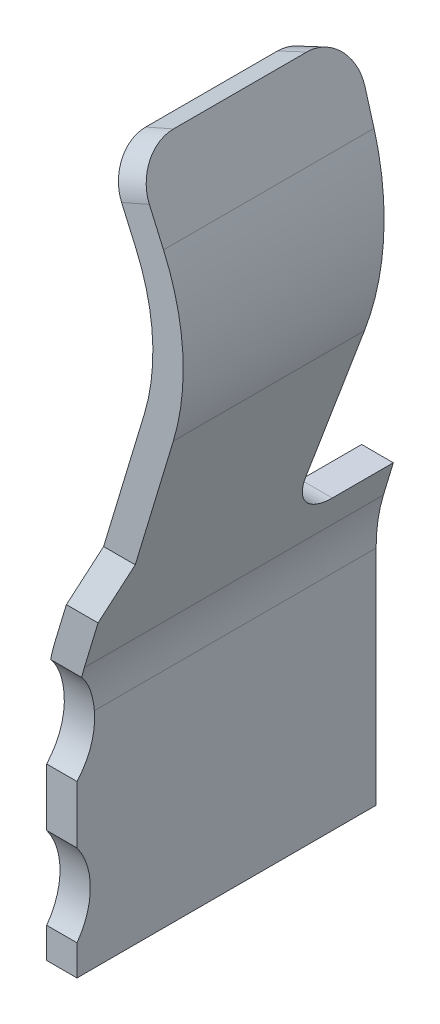
ISO-10303-21;
HEADER;
FILE_DESCRIPTION(('STEP AP214'),'2;1');
FILE_NAME('part.step','',(''),(''),'','','');
FILE_SCHEMA(('AUTOMOTIVE_DESIGN { 1 0 10303 214 1 1 1 1 }'));
ENDSEC;
DATA;
#1=APPLICATION_CONTEXT('core data for automotive mechanical design processes');
#2=APPLICATION_PROTOCOL_DEFINITION('international standard','automotive_design',2000,#1);
#3=PRODUCT_CONTEXT('',#1,'mechanical');
#4=PRODUCT('Part','Part','',(#3));
#5=PRODUCT_RELATED_PRODUCT_CATEGORY('part','',(#4));
#6=PRODUCT_DEFINITION_FORMATION('','',#4);
#7=PRODUCT_DEFINITION_CONTEXT('part definition',#1,'design');
#8=PRODUCT_DEFINITION('design','',#6,#7);
#9=PRODUCT_DEFINITION_SHAPE('','',#8);
#10=(LENGTH_UNIT() NAMED_UNIT(*) SI_UNIT(.MILLI.,.METRE.));
#11=(NAMED_UNIT(*) PLANE_ANGLE_UNIT() SI_UNIT($,.RADIAN.));
#12=(NAMED_UNIT(*) SI_UNIT($,.STERADIAN.) SOLID_ANGLE_UNIT());
#13=UNCERTAINTY_MEASURE_WITH_UNIT(LENGTH_MEASURE(1.E-05),#10,'distance_accuracy_value','');
#14=(GEOMETRIC_REPRESENTATION_CONTEXT(3) GLOBAL_UNCERTAINTY_ASSIGNED_CONTEXT((#13)) GLOBAL_UNIT_ASSIGNED_CONTEXT((#10,
#11,#12)) REPRESENTATION_CONTEXT('',''));
#15=CARTESIAN_POINT('',(0.,0.,0.));
#16=DIRECTION('',(0.,0.,1.));
#17=DIRECTION('',(1.,0.,0.));
#18=AXIS2_PLACEMENT_3D('',#15,#16,#17);
#19=CARTESIAN_POINT('',(-9.47613725867002,3.53312166947706,-0.236832722369338));
#20=DIRECTION('',(-0.914255270392897,-0.402239697454475,0.0483789866630426));
#21=DIRECTION('',(0.402711251685505,-0.915327071470026,0.));
#22=AXIS2_PLACEMENT_3D('',#19,#20,#21);
#23=CYLINDRICAL_SURFACE('',#22,0.2);
#24=CARTESIAN_POINT('',(-9.48964147732528,3.50329761180303,-0.434687053017797));
#25=CARTESIAN_POINT('',(-9.54071840447186,3.6193909515076,-0.448650066039084));
#26=CARTESIAN_POINT('',(-9.57898718351819,3.70637250294574,-0.363398989614743));
#27=CARTESIAN_POINT('',(-9.57898718351818,3.70637250294574,-0.235652283248446));
#28=(BOUNDED_CURVE() B_SPLINE_CURVE(3,(#24,#25,#26,#27),.UNSPECIFIED.,.F.,
.F.) B_SPLINE_CURVE_WITH_KNOTS((4,4),(3.0320715031167,4.71238898038462),
.UNSPECIFIED.) CURVE() GEOMETRIC_REPRESENTATION_ITEM() RATIONAL_B_SPLINE_CURVE((1.,
0.778229742533871,0.778229742533871,1.)) REPRESENTATION_ITEM(''));
#29=CARTESIAN_POINT('',(-9.48964147732528,3.50329761180303,-0.434687053017797));
#30=VERTEX_POINT('',#29);
#31=CARTESIAN_POINT('',(-9.57898718351818,3.70637250294574,-0.235652283248446));
#32=VERTEX_POINT('',#31);
#33=EDGE_CURVE('E289',#30,#32,#28,.T.);
#34=ORIENTED_EDGE('',*,*,#33,.F.);
#35=DIRECTION('',(0.914255270392898,0.402239697454473,-0.0483789866630426));
#36=VECTOR('',#35,1.);
#37=CARTESIAN_POINT('',(-33.537177596038,-7.07676024092296,0.837819069551529));
#38=LINE('',#37,#36);
#39=CARTESIAN_POINT('',(-9.62694053804578,3.44289092405021,-0.427421697659669));
#40=VERTEX_POINT('',#39);
#41=EDGE_CURVE('E11',#40,#30,#38,.T.);
#42=ORIENTED_EDGE('',*,*,#41,.F.);
#43=CARTESIAN_POINT('',(-9.71628624423869,3.64596581519291,-0.228386927890318));
#44=CARTESIAN_POINT('',(-9.71628624423869,3.64596581519291,-0.356133634256616));
#45=CARTESIAN_POINT('',(-9.67801746519238,3.55898426375477,-0.441384710680957));
#46=CARTESIAN_POINT('',(-9.62694053804578,3.44289092405021,-0.427421697659669));
#47=(BOUNDED_CURVE() B_SPLINE_CURVE(3,(#43,#44,#45,#46),.UNSPECIFIED.,.F.,
.F.) B_SPLINE_CURVE_WITH_KNOTS((4,4),(1.57079632679495,3.25111380406287),
.UNSPECIFIED.) CURVE() GEOMETRIC_REPRESENTATION_ITEM() RATIONAL_B_SPLINE_CURVE((1.,
0.778229742533869,0.778229742533869,1.)) REPRESENTATION_ITEM(''));
#48=CARTESIAN_POINT('',(-9.71628624423869,3.64596581519291,-0.228386927890318));
#49=VERTEX_POINT('',#48);
#50=EDGE_CURVE('E315',#49,#40,#47,.T.);
#51=ORIENTED_EDGE('',*,*,#50,.F.);
#52=DIRECTION('',(-0.914255270392898,-0.402239697454473,0.0483789866630426));
#53=VECTOR('',#52,1.);
#54=CARTESIAN_POINT('',(-9.55667950900712,3.71618708377106,-0.236832722369339));
#55=LINE('',#54,#53);
#56=EDGE_CURVE('E417',#32,#49,#55,.T.);
#57=ORIENTED_EDGE('',*,*,#56,.F.);
#58=EDGE_LOOP('',(#34,#42,#51,#57));
#59=FACE_BOUND('',#58,.T.);
#60=ADVANCED_FACE('F16',(#59),#23,.T.);
#61=CARTESIAN_POINT('',(-9.49844493318108,3.52330708865174,0.423604352914838));
#62=DIRECTION('',(0.915327071470026,0.402711251685505,0.));
#63=DIRECTION('',(-0.402711251685505,0.915327071470026,0.));
#64=AXIS2_PLACEMENT_3D('',#61,#62,#63);
#65=CYLINDRICAL_SURFACE('',#64,0.2);
#66=CARTESIAN_POINT('',(-9.63574399390159,3.46290040089891,0.423604352914837));
#67=DIRECTION('',(-0.915327071470029,-0.402711251685498,0.));
#68=DIRECTION('',(-0.402711251685498,0.915327071470029,0.));
#69=AXIS2_PLACEMENT_3D('',#66,#67,#68);
#70=CIRCLE('',#69,0.2);
#71=CARTESIAN_POINT('',(-9.63574399390159,3.46290040089891,0.623604352914837));
#72=VERTEX_POINT('',#71);
#73=CARTESIAN_POINT('',(-9.71628624423869,3.64596581519291,0.423604352914837));
#74=VERTEX_POINT('',#73);
#75=EDGE_CURVE('E416',#72,#74,#70,.T.);
#76=ORIENTED_EDGE('',*,*,#75,.F.);
#77=DIRECTION('',(-0.915327071470027,-0.402711251685503,0.));
#78=VECTOR('',#77,1.);
#79=CARTESIAN_POINT('',(-34.2530633966531,-7.36784176638169,0.623604352914803));
#80=LINE('',#79,#78);
#81=CARTESIAN_POINT('',(-9.49844493318109,3.52330708865174,0.623604352914837));
#82=VERTEX_POINT('',#81);
#83=EDGE_CURVE('E27',#82,#72,#80,.T.);
#84=ORIENTED_EDGE('',*,*,#83,.F.);
#85=CARTESIAN_POINT('',(-9.49844493318109,3.52330708865174,0.423604352914838));
#86=DIRECTION('',(0.915327071470029,0.402711251685498,0.));
#87=DIRECTION('',(0.402711251685498,-0.915327071470029,0.));
#88=AXIS2_PLACEMENT_3D('',#85,#86,#87);
#89=CIRCLE('',#88,0.2);
#90=CARTESIAN_POINT('',(-9.57898718351819,3.70637250294574,0.423604352914837));
#91=VERTEX_POINT('',#90);
#92=EDGE_CURVE('E283',#91,#82,#89,.T.);
#93=ORIENTED_EDGE('',*,*,#92,.F.);
#94=DIRECTION('',(0.915327071470027,0.402711251685503,0.));
#95=VECTOR('',#94,1.);
#96=CARTESIAN_POINT('',(-9.57898718351819,3.70637250294574,0.423604352914837));
#97=LINE('',#96,#95);
#98=EDGE_CURVE('E288',#74,#91,#97,.T.);
#99=ORIENTED_EDGE('',*,*,#98,.F.);
#100=EDGE_LOOP('',(#76,#84,#93,#99));
#101=FACE_BOUND('',#100,.T.);
#102=ADVANCED_FACE('F501',(#101),#65,.T.);
#103=CARTESIAN_POINT('',(-38.35,1.65634067151207,-0.212546111318104));
#104=DIRECTION('',(0.,-1.,0.));
#105=DIRECTION('',(0.,0.,-1.));
#106=AXIS2_PLACEMENT_3D('',#103,#104,#105);
#107=PLANE('',#106);
#108=DIRECTION('',(0.,0.,-1.));
#109=VECTOR('',#108,1.);
#110=CARTESIAN_POINT('',(-9.81150340910558,1.65634067151207,-0.740000000000021));
#111=LINE('',#110,#109);
#112=CARTESIAN_POINT('',(-9.81150340910558,1.65634067151207,-0.438042305987955));
#113=VERTEX_POINT('',#112);
#114=CARTESIAN_POINT('',(-9.81150340910558,1.65634067151207,-0.740000000000021));
#115=VERTEX_POINT('',#114);
#116=EDGE_CURVE('E311',#113,#115,#111,.T.);
#117=ORIENTED_EDGE('',*,*,#116,.F.);
#118=DIRECTION('',(1.,0.,0.));
#119=VECTOR('',#118,1.);
#120=CARTESIAN_POINT('',(-9.65483507894155,1.65634067151207,-0.438042305987954));
#121=LINE('',#120,#119);
#122=CARTESIAN_POINT('',(-9.65483507894154,1.65634067151207,-0.438042305987954));
#123=VERTEX_POINT('',#122);
#124=EDGE_CURVE('E232',#113,#123,#121,.T.);
#125=ORIENTED_EDGE('',*,*,#124,.T.);
#126=DIRECTION('',(0.,0.,1.));
#127=VECTOR('',#126,1.);
#128=CARTESIAN_POINT('',(-9.65483507894154,1.65634067151207,-0.74000000000002));
#129=LINE('',#128,#127);
#130=CARTESIAN_POINT('',(-9.65483507894154,1.65634067151207,-0.74000000000002));
#131=VERTEX_POINT('',#130);
#132=EDGE_CURVE('E227',#131,#123,#129,.T.);
#133=ORIENTED_EDGE('',*,*,#132,.F.);
#134=DIRECTION('',(-1.,0.,0.));
#135=VECTOR('',#134,1.);
#136=CARTESIAN_POINT('',(-8.89,1.65634067151207,-0.740000000000019));
#137=LINE('',#136,#135);
#138=EDGE_CURVE('E296',#131,#115,#137,.T.);
#139=ORIENTED_EDGE('',*,*,#138,.T.);
#140=EDGE_LOOP('',(#117,#125,#133,#139));
#141=FACE_BOUND('',#140,.T.);
#142=ADVANCED_FACE('F507',(#141),#107,.F.);
#143=CARTESIAN_POINT('',(-38.35,3.70637250294571,-0.459111687165995));
#144=DIRECTION('',(0.,0.119413416546905,0.992844618230162));
#145=DIRECTION('',(1.,0.,0.));
#146=AXIS2_PLACEMENT_3D('',#143,#144,#145);
#147=PLANE('',#146);
#148=DIRECTION('',(0.286748539926818,0.951150986717315,-0.11439875574724));
#149=VECTOR('',#148,1.);
#150=CARTESIAN_POINT('',(-9.68587763511194,1.55337185451571,-0.200161637444148));
#151=LINE('',#150,#149);
#152=CARTESIAN_POINT('',(-9.58733997726959,1.88022335482146,-0.239473382341922));
#153=VERTEX_POINT('',#152);
#154=CARTESIAN_POINT('',(-9.37979823954622,2.56864369924933,-0.322272466749581));
#155=VERTEX_POINT('',#154);
#156=EDGE_CURVE('E408',#153,#155,#151,.T.);
#157=ORIENTED_EDGE('',*,*,#156,.F.);
#158=DIRECTION('',(-1.,0.,0.));
#159=VECTOR('',#158,1.);
#160=CARTESIAN_POINT('',(-9.81150340910559,1.88022335482146,-0.239473382341922));
#161=LINE('',#160,#159);
#162=CARTESIAN_POINT('',(-9.74400830743363,1.88022335482146,-0.239473382341922));
#163=VERTEX_POINT('',#162);
#164=EDGE_CURVE('E238',#153,#163,#161,.T.);
#165=ORIENTED_EDGE('',*,*,#164,.T.);
#166=DIRECTION('',(-0.28674853992682,-0.951150986717314,0.11439875574724));
#167=VECTOR('',#166,1.);
#168=CARTESIAN_POINT('',(-9.82966395488851,1.59610175610151,-0.205300934614505));
#169=LINE('',#168,#167);
#170=CARTESIAN_POINT('',(-9.52341373590366,2.61194022573825,-0.327479914176623));
#171=VERTEX_POINT('',#170);
#172=EDGE_CURVE('E330',#171,#163,#169,.T.);
#173=ORIENTED_EDGE('',*,*,#172,.F.);
#174=CARTESIAN_POINT('',(-9.56552330681659,3.30329498734983,-0.410631932744419));
#175=CARTESIAN_POINT('',(-9.46854501029241,3.08287189317973,-0.384120760424612));
#176=CARTESIAN_POINT('',(-9.45390448882343,2.84250387207174,-0.355210731501567));
#177=CARTESIAN_POINT('',(-9.52341373590366,2.61194022573825,-0.327479914176623));
#178=(BOUNDED_CURVE() B_SPLINE_CURVE(3,(#174,#175,#176,#177),.UNSPECIFIED.,.F.,
.F.) B_SPLINE_CURVE_WITH_KNOTS((4,4),(4.29791199977039,5.00519872138853),
.UNSPECIFIED.) CURVE() GEOMETRIC_REPRESENTATION_ITEM() RATIONAL_B_SPLINE_CURVE((1.,
0.958744787021091,0.958744787021091,1.)) REPRESENTATION_ITEM(''));
#179=CARTESIAN_POINT('',(-9.56552330681659,3.30329498734983,-0.410631932744419));
#180=VERTEX_POINT('',#179);
#181=EDGE_CURVE('E294',#180,#171,#178,.T.);
#182=ORIENTED_EDGE('',*,*,#181,.F.);
#183=DIRECTION('',(0.400292818236851,-0.909830186054405,0.109428936813833));
#184=VECTOR('',#183,1.);
#185=CARTESIAN_POINT('',(-9.57995081965594,3.33608744850051,-0.414576013974334));
#186=LINE('',#185,#184);
#187=EDGE_CURVE('E295',#40,#180,#186,.T.);
#188=ORIENTED_EDGE('',*,*,#187,.F.);
#189=ORIENTED_EDGE('',*,*,#41,.T.);
#190=DIRECTION('',(-0.40029281823685,0.909830186054405,-0.109428936813833));
#191=VECTOR('',#190,1.);
#192=CARTESIAN_POINT('',(-9.44233351008822,3.39577078475993,-0.421754368938235));
#193=LINE('',#192,#191);
#194=CARTESIAN_POINT('',(-9.42822424609609,3.36370167510267,-0.417897288102547));
#195=VERTEX_POINT('',#194);
#196=EDGE_CURVE('E282',#195,#30,#193,.T.);
#197=ORIENTED_EDGE('',*,*,#196,.F.);
#198=CARTESIAN_POINT('',(-9.37979823954622,2.56864369924933,-0.322272466749581));
#199=CARTESIAN_POINT('',(-9.29986260540396,2.83379189253285,-0.354162906673267));
#200=CARTESIAN_POINT('',(-9.31669920509328,3.11021511680704,-0.387409439934769));
#201=CARTESIAN_POINT('',(-9.42822424609609,3.36370167510267,-0.417897288102547));
#202=(BOUNDED_CURVE() B_SPLINE_CURVE(3,(#198,#199,#200,#201),.UNSPECIFIED.,.F.,
.F.) B_SPLINE_CURVE_WITH_KNOTS((4,4),(1.27798658579106,1.98527330740919),
.UNSPECIFIED.) CURVE() GEOMETRIC_REPRESENTATION_ITEM() RATIONAL_B_SPLINE_CURVE((1.,
0.958744787021091,0.958744787021091,1.)) REPRESENTATION_ITEM(''));
#203=EDGE_CURVE('E388',#155,#195,#202,.T.);
#204=ORIENTED_EDGE('',*,*,#203,.F.);
#205=EDGE_LOOP('',(#157,#165,#173,#182,#188,#189,#197,#204));
#206=FACE_BOUND('',#205,.T.);
#207=ADVANCED_FACE('F18',(#206),#147,.F.);
#208=CARTESIAN_POINT('',(-38.35,1.94413292378283,0.623604352914797));
#209=DIRECTION('',(0.,0.,-1.));
#210=DIRECTION('',(0.,-1.,0.));
#211=AXIS2_PLACEMENT_3D('',#208,#209,#210);
#212=PLANE('',#211);
#213=DIRECTION('',(0.4027112516855,-0.915327071470028,0.));
#214=VECTOR('',#213,1.);
#215=CARTESIAN_POINT('',(-9.42822424609609,3.36370167510267,0.623604352914838));
#216=LINE('',#215,#214);
#217=CARTESIAN_POINT('',(-9.42822424609609,3.36370167510267,0.623604352914838));
#218=VERTEX_POINT('',#217);
#219=EDGE_CURVE('E279',#82,#218,#216,.T.);
#220=ORIENTED_EDGE('',*,*,#219,.F.);
#221=ORIENTED_EDGE('',*,*,#83,.T.);
#222=DIRECTION('',(-0.402711251685501,0.915327071470028,0.));
#223=VECTOR('',#222,1.);
#224=CARTESIAN_POINT('',(-9.56552330681659,3.30329498734984,0.623604352914837));
#225=LINE('',#224,#223);
#226=CARTESIAN_POINT('',(-9.56552330681659,3.30329498734983,0.623604352914837));
#227=VERTEX_POINT('',#226);
#228=EDGE_CURVE('E413',#227,#72,#225,.T.);
#229=ORIENTED_EDGE('',*,*,#228,.F.);
#230=CARTESIAN_POINT('',(-10.4808503782866,2.90058373566433,0.623604352914836));
#231=DIRECTION('',(0.,0.,1.));
#232=DIRECTION('',(-1.,0.,0.));
#233=AXIS2_PLACEMENT_3D('',#230,#231,#232);
#234=CIRCLE('',#233,1.);
#235=CARTESIAN_POINT('',(-9.52341373590367,2.61194022573825,0.623604352914837));
#236=VERTEX_POINT('',#235);
#237=EDGE_CURVE('E304',#236,#227,#234,.T.);
#238=ORIENTED_EDGE('',*,*,#237,.F.);
#239=DIRECTION('',(0.28864350992609,0.957436642382956,0.));
#240=VECTOR('',#239,1.);
#241=CARTESIAN_POINT('',(-9.84743664238296,1.53714937485737,0.623604352914836));
#242=LINE('',#241,#240);
#243=CARTESIAN_POINT('',(-9.72474115022836,1.94413292378283,0.623604352914837));
#244=VERTEX_POINT('',#243);
#245=EDGE_CURVE('E274',#244,#236,#242,.T.);
#246=ORIENTED_EDGE('',*,*,#245,.F.);
#247=DIRECTION('',(1.,0.,0.));
#248=VECTOR('',#247,1.);
#249=CARTESIAN_POINT('',(-38.35,1.94413292378283,0.623604352914797));
#250=LINE('',#249,#248);
#251=CARTESIAN_POINT('',(-9.56807282006433,1.94413292378283,0.623604352914837));
#252=VERTEX_POINT('',#251);
#253=EDGE_CURVE('E299',#244,#252,#250,.T.);
#254=ORIENTED_EDGE('',*,*,#253,.T.);
#255=DIRECTION('',(-0.288643509926088,-0.957436642382956,0.));
#256=VECTOR('',#255,1.);
#257=CARTESIAN_POINT('',(-9.70382114602552,1.49385284836845,0.623604352914837));
#258=LINE('',#257,#256);
#259=CARTESIAN_POINT('',(-9.37979823954622,2.56864369924933,0.623604352914837));
#260=VERTEX_POINT('',#259);
#261=EDGE_CURVE('E316',#260,#252,#258,.T.);
#262=ORIENTED_EDGE('',*,*,#261,.F.);
#263=CARTESIAN_POINT('',(-10.4808503782866,2.90058373566433,0.623604352914836));
#264=DIRECTION('',(0.,0.,-1.));
#265=DIRECTION('',(-1.,0.,0.));
#266=AXIS2_PLACEMENT_3D('',#263,#264,#265);
#267=CIRCLE('',#266,1.15);
#268=EDGE_CURVE('E260',#218,#260,#267,.T.);
#269=ORIENTED_EDGE('',*,*,#268,.F.);
#270=EDGE_LOOP('',(#220,#221,#229,#238,#246,#254,#262,#269));
#271=FACE_BOUND('',#270,.T.);
#272=ADVANCED_FACE('F522',(#271),#212,.F.);
#273=CARTESIAN_POINT('',(-38.35,1.7003498353216,0.749999999999972));
#274=DIRECTION('',(0.,-0.460287319631494,-0.887770005906065));
#275=DIRECTION('',(0.,-0.887770005906065,0.460287319631494));
#276=AXIS2_PLACEMENT_3D('',#273,#274,#275);
#277=PLANE('',#276);
#278=ORIENTED_EDGE('',*,*,#253,.F.);
#279=DIRECTION('',(0.258541028225373,0.857586072334425,-0.444637678635293));
#280=VECTOR('',#279,1.);
#281=CARTESIAN_POINT('',(-9.66642343830644,2.13757401070795,0.523309818502746));
#282=LINE('',#281,#280);
#283=CARTESIAN_POINT('',(-9.79242108767926,1.7196371362757,0.73999999999998));
#284=VERTEX_POINT('',#283);
#285=EDGE_CURVE('E268',#284,#244,#282,.T.);
#286=ORIENTED_EDGE('',*,*,#285,.F.);
#287=DIRECTION('',(-1.,0.,0.));
#288=VECTOR('',#287,1.);
#289=CARTESIAN_POINT('',(-8.89,1.7196371362757,0.739999999999981));
#290=LINE('',#289,#288);
#291=CARTESIAN_POINT('',(-9.63575275751523,1.7196371362757,0.73999999999998));
#292=VERTEX_POINT('',#291);
#293=EDGE_CURVE('E392',#292,#284,#290,.T.);
#294=ORIENTED_EDGE('',*,*,#293,.F.);
#295=DIRECTION('',(-0.258541028225372,-0.857586072334425,0.444637678635293));
#296=VECTOR('',#295,1.);
#297=CARTESIAN_POINT('',(-9.5202273619162,2.10283732290249,0.541319952677682));
#298=LINE('',#297,#296);
#299=EDGE_CURVE('E320',#252,#292,#298,.T.);
#300=ORIENTED_EDGE('',*,*,#299,.F.);
#301=EDGE_LOOP('',(#278,#286,#294,#300));
#302=FACE_BOUND('',#301,.T.);
#303=ADVANCED_FACE('F497',(#302),#277,.F.);
#304=CARTESIAN_POINT('',(-8.89,1.24850586493128,0.739999999999981));
#305=DIRECTION('',(0.,0.,-1.));
#306=DIRECTION('',(0.,-1.,0.));
#307=AXIS2_PLACEMENT_3D('',#304,#305,#306);
#308=PLANE('',#307);
#309=DIRECTION('',(0.,1.,0.));
#310=VECTOR('',#309,1.);
#311=CARTESIAN_POINT('',(-9.74,0.145965815192914,0.73999999999998));
#312=LINE('',#311,#310);
#313=CARTESIAN_POINT('',(-9.74,0.145965815192914,0.73999999999998));
#314=VERTEX_POINT('',#313);
#315=CARTESIAN_POINT('',(-9.74,0.296740599868486,0.73999999999998));
#316=VERTEX_POINT('',#315);
#317=EDGE_CURVE('E259',#314,#316,#312,.T.);
#318=ORIENTED_EDGE('',*,*,#317,.T.);
#319=DIRECTION('',(-1.,0.,0.));
#320=VECTOR('',#319,1.);
#321=CARTESIAN_POINT('',(-38.35,0.296740599868486,0.73999999999994));
#322=LINE('',#321,#320);
#323=CARTESIAN_POINT('',(-9.89,0.296740599868486,0.739999999999979));
#324=VERTEX_POINT('',#323);
#325=EDGE_CURVE('E327',#316,#324,#322,.T.);
#326=ORIENTED_EDGE('',*,*,#325,.T.);
#327=DIRECTION('',(0.,-1.,0.));
#328=VECTOR('',#327,1.);
#329=CARTESIAN_POINT('',(-9.89,0.145965815192914,0.739999999999979));
#330=LINE('',#329,#328);
#331=CARTESIAN_POINT('',(-9.89,0.145965815192914,0.739999999999979));
#332=VERTEX_POINT('',#331);
#333=EDGE_CURVE('E249',#324,#332,#330,.T.);
#334=ORIENTED_EDGE('',*,*,#333,.T.);
#335=DIRECTION('',(1.,0.,0.));
#336=VECTOR('',#335,1.);
#337=CARTESIAN_POINT('',(-9.74,0.145965815192914,0.73999999999998));
#338=LINE('',#337,#336);
#339=EDGE_CURVE('E421',#332,#314,#338,.T.);
#340=ORIENTED_EDGE('',*,*,#339,.T.);
#341=EDGE_LOOP('',(#318,#326,#334,#340));
#342=FACE_BOUND('',#341,.T.);
#343=ADVANCED_FACE('F492',(#342),#308,.F.);
#344=CARTESIAN_POINT('',(-8.89,1.24850586493128,-0.740000000000019));
#345=DIRECTION('',(0.,0.,-1.));
#346=DIRECTION('',(0.,-1.,0.));
#347=AXIS2_PLACEMENT_3D('',#344,#345,#346);
#348=PLANE('',#347);
#349=ORIENTED_EDGE('',*,*,#138,.F.);
#350=DIRECTION('',(0.288643509926088,0.957436642382956,0.));
#351=VECTOR('',#350,1.);
#352=CARTESIAN_POINT('',(-9.70382114602551,1.49385284836845,-0.74000000000002));
#353=LINE('',#352,#351);
#354=CARTESIAN_POINT('',(-9.70382114602551,1.49385284836845,-0.74000000000002));
#355=VERTEX_POINT('',#354);
#356=EDGE_CURVE('E307',#355,#131,#353,.T.);
#357=ORIENTED_EDGE('',*,*,#356,.F.);
#358=CARTESIAN_POINT('',(-8.89,1.24850586493128,-0.740000000000019));
#359=DIRECTION('',(0.,0.,-1.));
#360=DIRECTION('',(1.,0.,0.));
#361=AXIS2_PLACEMENT_3D('',#358,#359,#360);
#362=CIRCLE('',#361,0.85);
#363=CARTESIAN_POINT('',(-9.74,1.24850586493128,-0.74000000000002));
#364=VERTEX_POINT('',#363);
#365=EDGE_CURVE('E258',#364,#355,#362,.T.);
#366=ORIENTED_EDGE('',*,*,#365,.F.);
#367=DIRECTION('',(0.,1.,0.));
#368=VECTOR('',#367,1.);
#369=CARTESIAN_POINT('',(-9.74,0.145965815192914,-0.74000000000002));
#370=LINE('',#369,#368);
#371=CARTESIAN_POINT('',(-9.74,0.145965815192914,-0.74000000000002));
#372=VERTEX_POINT('',#371);
#373=EDGE_CURVE('E251',#372,#364,#370,.T.);
#374=ORIENTED_EDGE('',*,*,#373,.F.);
#375=DIRECTION('',(1.,0.,0.));
#376=VECTOR('',#375,1.);
#377=CARTESIAN_POINT('',(-9.74,0.145965815192914,-0.74000000000002));
#378=LINE('',#377,#376);
#379=CARTESIAN_POINT('',(-9.89,0.145965815192914,-0.740000000000021));
#380=VERTEX_POINT('',#379);
#381=EDGE_CURVE('E368',#380,#372,#378,.T.);
#382=ORIENTED_EDGE('',*,*,#381,.F.);
#383=DIRECTION('',(0.,-1.,0.));
#384=VECTOR('',#383,1.);
#385=CARTESIAN_POINT('',(-9.89,0.145965815192914,-0.740000000000021));
#386=LINE('',#385,#384);
#387=CARTESIAN_POINT('',(-9.89,1.24850586493128,-0.740000000000021));
#388=VERTEX_POINT('',#387);
#389=EDGE_CURVE('E41',#388,#380,#386,.T.);
#390=ORIENTED_EDGE('',*,*,#389,.F.);
#391=CARTESIAN_POINT('',(-8.89,1.24850586493128,-0.740000000000019));
#392=DIRECTION('',(0.,0.,1.));
#393=DIRECTION('',(1.,0.,0.));
#394=AXIS2_PLACEMENT_3D('',#391,#392,#393);
#395=CIRCLE('',#394,1.);
#396=CARTESIAN_POINT('',(-9.84743664238296,1.53714937485737,-0.740000000000021));
#397=VERTEX_POINT('',#396);
#398=EDGE_CURVE('E391',#397,#388,#395,.T.);
#399=ORIENTED_EDGE('',*,*,#398,.F.);
#400=DIRECTION('',(-0.28864350992609,-0.957436642382956,0.));
#401=VECTOR('',#400,1.);
#402=CARTESIAN_POINT('',(-9.84743664238296,1.53714937485737,-0.740000000000021));
#403=LINE('',#402,#401);
#404=EDGE_CURVE('E269',#115,#397,#403,.T.);
#405=ORIENTED_EDGE('',*,*,#404,.F.);
#406=EDGE_LOOP('',(#349,#357,#366,#374,#382,#390,#399,#405));
#407=FACE_BOUND('',#406,.T.);
#408=ADVANCED_FACE('F482',(#407),#348,.T.);
#409=CARTESIAN_POINT('',(-9.89,0.145965815192914,-0.740000000000021));
#410=DIRECTION('',(1.,0.,0.));
#411=DIRECTION('',(0.,1.,0.));
#412=AXIS2_PLACEMENT_3D('',#409,#410,#411);
#413=PLANE('',#412);
#414=DIRECTION('',(0.,-1.,0.));
#415=VECTOR('',#414,1.);
#416=CARTESIAN_POINT('',(-9.89,0.145965815192914,0.739999999999979));
#417=LINE('',#416,#415);
#418=CARTESIAN_POINT('',(-9.89,0.988055123608201,0.739999999999979));
#419=VERTEX_POINT('',#418);
#420=CARTESIAN_POINT('',(-9.89,0.703259400131467,0.739999999999979));
#421=VERTEX_POINT('',#420);
#422=EDGE_CURVE('E428',#419,#421,#417,.T.);
#423=ORIENTED_EDGE('',*,*,#422,.F.);
#424=CARTESIAN_POINT('',(-9.89,1.21669179396546,0.995153761033096));
#425=DIRECTION('',(1.,0.,0.));
#426=DIRECTION('',(0.,1.,0.));
#427=AXIS2_PLACEMENT_3D('',#424,#425,#426);
#428=CIRCLE('',#427,0.342604974863759);
#429=CARTESIAN_POINT('',(-9.89,1.24850586493128,0.654029100989324));
#430=VERTEX_POINT('',#429);
#431=EDGE_CURVE('E340',#419,#430,#428,.T.);
#432=ORIENTED_EDGE('',*,*,#431,.T.);
#433=DIRECTION('',(0.,0.,1.));
#434=VECTOR('',#433,1.);
#435=CARTESIAN_POINT('',(-9.89,1.24850586493128,-0.740000000000021));
#436=LINE('',#435,#434);
#437=EDGE_CURVE('E278',#388,#430,#436,.T.);
#438=ORIENTED_EDGE('',*,*,#437,.F.);
#439=ORIENTED_EDGE('',*,*,#389,.T.);
#440=DIRECTION('',(0.,0.,1.));
#441=VECTOR('',#440,1.);
#442=CARTESIAN_POINT('',(-9.89,0.145965815192914,-0.740000000000021));
#443=LINE('',#442,#441);
#444=EDGE_CURVE('E373',#380,#332,#443,.T.);
#445=ORIENTED_EDGE('',*,*,#444,.T.);
#446=ORIENTED_EDGE('',*,*,#333,.F.);
#447=CARTESIAN_POINT('',(-9.89,0.499999999999977,1.0194268345702));
#448=DIRECTION('',(1.,0.,0.));
#449=DIRECTION('',(0.,1.,0.));
#450=AXIS2_PLACEMENT_3D('',#447,#448,#449);
#451=CIRCLE('',#450,0.345533991988848);
#452=EDGE_CURVE('E334',#324,#421,#451,.T.);
#453=ORIENTED_EDGE('',*,*,#452,.T.);
#454=EDGE_LOOP('',(#423,#432,#438,#439,#445,#446,#453));
#455=FACE_BOUND('',#454,.T.);
#456=ADVANCED_FACE('F471',(#455),#413,.F.);
#457=CARTESIAN_POINT('',(-8.89,1.24850586493128,-0.740000000000019));
#458=DIRECTION('',(0.,0.,1.));
#459=DIRECTION('',(-1.,0.,0.));
#460=AXIS2_PLACEMENT_3D('',#457,#458,#459);
#461=CYLINDRICAL_SURFACE('',#460,1.);
#462=ORIENTED_EDGE('',*,*,#437,.T.);
#463=CARTESIAN_POINT('',(-9.89,1.24850586493127,0.654029100989324));
#464=CARTESIAN_POINT('',(-9.89000007407363,1.25306932177748,0.654454497923835));
#465=CARTESIAN_POINT('',(-9.88996876472137,1.25762446546712,0.654969794425774));
#466=CARTESIAN_POINT('',(-9.88984483490432,1.26669234380872,0.656178662703507));
#467=CARTESIAN_POINT('',(-9.88975245079703,1.27120517419842,0.656871540938563));
#468=CARTESIAN_POINT('',(-9.88950808670678,1.28018764830056,0.658435530000101));
#469=CARTESIAN_POINT('',(-9.88935624289613,1.28465736694881,0.659306231418194));
#470=CARTESIAN_POINT('',(-9.88899477703105,1.29355289226453,0.661225514697385));
#471=CARTESIAN_POINT('',(-9.8887851944591,1.29797872680563,0.66227397481712));
#472=CARTESIAN_POINT('',(-9.88831002792707,1.30678583476397,0.664548502475786));
#473=CARTESIAN_POINT('',(-9.88804439252603,1.31116706334694,0.665774732832754));
#474=CARTESIAN_POINT('',(-9.88745889152881,1.31988437499395,0.668404514864849));
#475=CARTESIAN_POINT('',(-9.88713889099457,1.32422031651338,0.669808505488944));
#476=CARTESIAN_POINT('',(-9.88644641069623,1.33284654509273,0.672793524574298));
#477=CARTESIAN_POINT('',(-9.88607372137307,1.33713657245114,0.67437525453736));
#478=CARTESIAN_POINT('',(-9.88527760241854,1.34567049059148,0.677715533217567));
#479=CARTESIAN_POINT('',(-9.88485389867301,1.34991398511754,0.679475028174295));
#480=CARTESIAN_POINT('',(-9.88396321849389,1.35830019523904,0.683146652073494));
#481=CARTESIAN_POINT('',(-9.88349650719558,1.36244335249443,0.6850578369075));
#482=CARTESIAN_POINT('',(-9.88252312860201,1.37063194178074,0.689033531510101));
#483=CARTESIAN_POINT('',(-9.88201661211662,1.3746776733665,0.691097460992356));
#484=CARTESIAN_POINT('',(-9.88096713168236,1.38267128376232,0.695378434355306));
#485=CARTESIAN_POINT('',(-9.88042424735263,1.3866193519919,0.697595144046891));
#486=CARTESIAN_POINT('',(-9.87930544298223,1.39441764648526,0.702181418874192));
#487=CARTESIAN_POINT('',(-9.87872954299439,1.39826793013232,0.704550891332612));
#488=CARTESIAN_POINT('',(-9.87754802962805,1.40587073759695,0.709442454924468));
#489=CARTESIAN_POINT('',(-9.87694238918284,1.40962316741917,0.71196468558873));
#490=CARTESIAN_POINT('',(-9.87570462073635,1.4170304504751,0.717161525963166));
#491=CARTESIAN_POINT('',(-9.87507243147301,1.42068504210779,0.719836493879692));
#492=CARTESIAN_POINT('',(-9.87378470654221,1.42789683764576,0.725338623347789));
#493=CARTESIAN_POINT('',(-9.87312908847075,1.43145359950846,0.728166344681211));
#494=CARTESIAN_POINT('',(-9.87179751594577,1.43847023752972,0.733973670299353));
#495=CARTESIAN_POINT('',(-9.87112147050096,1.44192948379825,0.736954014976151));
#496=CARTESIAN_POINT('',(-9.87043911813473,1.44532846432271,0.73999999999998));
#497=B_SPLINE_CURVE_WITH_KNOTS('',3,(#463,#464,#465,#466,#467,#468,#469,#470,#471,#472,#473,
#474,#475,#476,#477,#478,#479,#480,#481,#482,#483,#484,#485,#486,#487,#488,#489,#490,#491,#492,
#493,#494,#495,#496),.UNSPECIFIED.,.F.,.F.,(4,2,2,2,2,2,2,2,2,2,2,2,2,2,2,2,4),(0.,
0.013748827736232,0.0274447569667543,0.0411095020469267,0.0547649260984996,0.0684329369744623,
0.0821353821572885,0.0958939450956066,0.109730045405059,0.123485924962942,0.137191991355335,
0.150868974599206,0.164537737053089,0.17821917870054,0.191934141578146,0.205703315519925,
0.219547147320743),.UNSPECIFIED.);
#498=CARTESIAN_POINT('',(-9.87043911813473,1.44532846432271,0.739999999999979));
#499=VERTEX_POINT('',#498);
#500=EDGE_CURVE('E453',#430,#499,#497,.T.);
#501=ORIENTED_EDGE('',*,*,#500,.T.);
#502=CARTESIAN_POINT('',(-8.89,1.24850586493128,0.739999999999981));
#503=DIRECTION('',(0.,0.,1.));
#504=DIRECTION('',(1.,0.,0.));
#505=AXIS2_PLACEMENT_3D('',#502,#503,#504);
#506=CIRCLE('',#505,1.);
#507=CARTESIAN_POINT('',(-9.84743664238296,1.53714937485737,0.739999999999979));
#508=VERTEX_POINT('',#507);
#509=EDGE_CURVE('E551',#508,#499,#506,.T.);
#510=ORIENTED_EDGE('',*,*,#509,.F.);
#511=DIRECTION('',(0.,0.,1.));
#512=VECTOR('',#511,1.);
#513=CARTESIAN_POINT('',(-9.84743664238296,1.53714937485737,-0.740000000000021));
#514=LINE('',#513,#512);
#515=EDGE_CURVE('E265',#397,#508,#514,.T.);
#516=ORIENTED_EDGE('',*,*,#515,.F.);
#517=ORIENTED_EDGE('',*,*,#398,.T.);
#518=EDGE_LOOP('',(#462,#501,#510,#516,#517));
#519=FACE_BOUND('',#518,.T.);
#520=ADVANCED_FACE('F460',(#519),#461,.T.);
#521=CARTESIAN_POINT('',(-9.84743664238296,1.53714937485737,-0.740000000000021));
#522=DIRECTION('',(0.957436642382956,-0.28864350992609,0.));
#523=DIRECTION('',(0.,0.,-1.));
#524=AXIS2_PLACEMENT_3D('',#521,#522,#523);
#525=PLANE('',#524);
#526=ORIENTED_EDGE('',*,*,#172,.T.);
#527=CARTESIAN_POINT('',(-9.74400830743363,1.88022335482146,-0.239473382341922));
#528=CARTESIAN_POINT('',(-9.74639827429865,1.87229578405696,-0.238519901512672));
#529=CARTESIAN_POINT('',(-9.74880115558452,1.86432537588468,-0.238042305987954));
#530=CARTESIAN_POINT('',(-9.75120834682184,1.85634067151208,-0.238042305987954));
#531=(BOUNDED_CURVE() B_SPLINE_CURVE(3,(#527,#528,#529,#530),.UNSPECIFIED.,.F.,
.F.) B_SPLINE_CURVE_WITH_KNOTS((4,4),(4.59268992994791,4.71238898038469),
.UNSPECIFIED.) CURVE() GEOMETRIC_REPRESENTATION_ITEM() RATIONAL_B_SPLINE_CURVE((1.,
0.998806367803328,0.998806367803328,1.)) REPRESENTATION_ITEM(''));
#532=CARTESIAN_POINT('',(-9.75120834682184,1.85634067151208,-0.238042305987954));
#533=VERTEX_POINT('',#532);
#534=EDGE_CURVE('E346',#163,#533,#531,.T.);
#535=ORIENTED_EDGE('',*,*,#534,.T.);
#536=CARTESIAN_POINT('',(-9.75120834682184,1.85634067151208,-0.238042305987954));
#537=CARTESIAN_POINT('',(-9.78652837656353,1.73918338398669,-0.238042305987954));
#538=CARTESIAN_POINT('',(-9.81150340910557,1.65634067151208,-0.320885018462573));
#539=CARTESIAN_POINT('',(-9.81150340910558,1.65634067151207,-0.438042305987955));
#540=(BOUNDED_CURVE() B_SPLINE_CURVE(3,(#536,#537,#538,#539),.UNSPECIFIED.,.F.,
.F.) B_SPLINE_CURVE_WITH_KNOTS((4,4),(4.71238898038469,6.28318530717959),
.UNSPECIFIED.) CURVE() GEOMETRIC_REPRESENTATION_ITEM() RATIONAL_B_SPLINE_CURVE((1.,
0.804737854124365,0.804737854124365,1.)) REPRESENTATION_ITEM(''));
#541=EDGE_CURVE('E355',#533,#113,#540,.T.);
#542=ORIENTED_EDGE('',*,*,#541,.T.);
#543=ORIENTED_EDGE('',*,*,#116,.T.);
#544=ORIENTED_EDGE('',*,*,#404,.T.);
#545=ORIENTED_EDGE('',*,*,#515,.T.);
#546=DIRECTION('',(-0.28864350992609,-0.957436642382956,0.));
#547=VECTOR('',#546,1.);
#548=CARTESIAN_POINT('',(-9.84743664238296,1.53714937485737,0.739999999999979));
#549=LINE('',#548,#547);
#550=EDGE_CURVE('E396',#284,#508,#549,.T.);
#551=ORIENTED_EDGE('',*,*,#550,.F.);
#552=ORIENTED_EDGE('',*,*,#285,.T.);
#553=ORIENTED_EDGE('',*,*,#245,.T.);
#554=DIRECTION('',(0.,0.,1.));
#555=VECTOR('',#554,1.);
#556=CARTESIAN_POINT('',(-9.52341373590366,2.61194022573825,-0.74000000000002));
#557=LINE('',#556,#555);
#558=EDGE_CURVE('E300',#171,#236,#557,.T.);
#559=ORIENTED_EDGE('',*,*,#558,.F.);
#560=EDGE_LOOP('',(#526,#535,#542,#543,#544,#545,#551,#552,#553,#559));
#561=FACE_BOUND('',#560,.T.);
#562=ADVANCED_FACE('F470',(#561),#525,.F.);
#563=CARTESIAN_POINT('',(-10.4808503782866,2.90058373566433,-0.740000000000021));
#564=DIRECTION('',(0.,0.,1.));
#565=DIRECTION('',(-1.,0.,0.));
#566=AXIS2_PLACEMENT_3D('',#563,#564,#565);
#567=CYLINDRICAL_SURFACE('',#566,1.);
#568=DIRECTION('',(0.,0.,1.));
#569=VECTOR('',#568,1.);
#570=CARTESIAN_POINT('',(-9.56552330681659,3.30329498734983,-0.74000000000002));
#571=LINE('',#570,#569);
#572=EDGE_CURVE('E290',#180,#227,#571,.T.);
#573=ORIENTED_EDGE('',*,*,#572,.F.);
#574=ORIENTED_EDGE('',*,*,#181,.T.);
#575=ORIENTED_EDGE('',*,*,#558,.T.);
#576=ORIENTED_EDGE('',*,*,#237,.T.);
#577=EDGE_LOOP('',(#573,#574,#575,#576));
#578=FACE_BOUND('',#577,.T.);
#579=ADVANCED_FACE('F478',(#578),#567,.F.);
#580=CARTESIAN_POINT('',(-9.56552330681658,3.30329498734984,-0.74000000000002));
#581=DIRECTION('',(0.915327071470028,0.402711251685501,0.));
#582=DIRECTION('',(0.,0.,-1.));
#583=AXIS2_PLACEMENT_3D('',#580,#581,#582);
#584=PLANE('',#583);
#585=ORIENTED_EDGE('',*,*,#228,.T.);
#586=ORIENTED_EDGE('',*,*,#75,.T.);
#587=DIRECTION('',(0.,0.,1.));
#588=VECTOR('',#587,1.);
#589=CARTESIAN_POINT('',(-9.71628624423869,3.64596581519291,-0.740000000000021));
#590=LINE('',#589,#588);
#591=EDGE_CURVE('E284',#49,#74,#590,.T.);
#592=ORIENTED_EDGE('',*,*,#591,.F.);
#593=ORIENTED_EDGE('',*,*,#50,.T.);
#594=ORIENTED_EDGE('',*,*,#187,.T.);
#595=ORIENTED_EDGE('',*,*,#572,.T.);
#596=EDGE_LOOP('',(#585,#586,#592,#593,#594,#595));
#597=FACE_BOUND('',#596,.T.);
#598=ADVANCED_FACE('F474',(#597),#584,.F.);
#599=CARTESIAN_POINT('',(-9.57898718351818,3.70637250294574,-0.74000000000002));
#600=DIRECTION('',(0.402711251685503,-0.915327071470027,0.));
#601=DIRECTION('',(0.,0.,-1.));
#602=AXIS2_PLACEMENT_3D('',#599,#600,#601);
#603=PLANE('',#602);
#604=ORIENTED_EDGE('',*,*,#591,.T.);
#605=ORIENTED_EDGE('',*,*,#98,.T.);
#606=DIRECTION('',(0.,0.,1.));
#607=VECTOR('',#606,1.);
#608=CARTESIAN_POINT('',(-9.57898718351818,3.70637250294574,-0.74000000000002));
#609=LINE('',#608,#607);
#610=EDGE_CURVE('E263',#32,#91,#609,.T.);
#611=ORIENTED_EDGE('',*,*,#610,.F.);
#612=ORIENTED_EDGE('',*,*,#56,.T.);
#613=EDGE_LOOP('',(#604,#605,#611,#612));
#614=FACE_BOUND('',#613,.T.);
#615=ADVANCED_FACE('F477',(#614),#603,.F.);
#616=CARTESIAN_POINT('',(-9.42822424609609,3.36370167510267,-0.74000000000002));
#617=DIRECTION('',(-0.915327071470028,-0.4027112516855,0.));
#618=DIRECTION('',(-0.4027112516855,0.915327071470028,0.));
#619=AXIS2_PLACEMENT_3D('',#616,#617,#618);
#620=PLANE('',#619);
#621=ORIENTED_EDGE('',*,*,#610,.T.);
#622=ORIENTED_EDGE('',*,*,#92,.T.);
#623=ORIENTED_EDGE('',*,*,#219,.T.);
#624=DIRECTION('',(0.,0.,1.));
#625=VECTOR('',#624,1.);
#626=CARTESIAN_POINT('',(-9.42822424609609,3.36370167510267,-0.74000000000002));
#627=LINE('',#626,#625);
#628=EDGE_CURVE('E264',#195,#218,#627,.T.);
#629=ORIENTED_EDGE('',*,*,#628,.F.);
#630=ORIENTED_EDGE('',*,*,#196,.T.);
#631=ORIENTED_EDGE('',*,*,#33,.T.);
#632=EDGE_LOOP('',(#621,#622,#623,#629,#630,#631));
#633=FACE_BOUND('',#632,.T.);
#634=ADVANCED_FACE('F489',(#633),#620,.F.);
#635=CARTESIAN_POINT('',(-10.4808503782866,2.90058373566433,-0.740000000000021));
#636=DIRECTION('',(0.,0.,1.));
#637=DIRECTION('',(-1.,0.,0.));
#638=AXIS2_PLACEMENT_3D('',#635,#636,#637);
#639=CYLINDRICAL_SURFACE('',#638,1.15);
#640=DIRECTION('',(0.,0.,1.));
#641=VECTOR('',#640,1.);
#642=CARTESIAN_POINT('',(-9.37979823954622,2.56864369924933,-0.74000000000002));
#643=LINE('',#642,#641);
#644=EDGE_CURVE('E321',#155,#260,#643,.T.);
#645=ORIENTED_EDGE('',*,*,#644,.F.);
#646=ORIENTED_EDGE('',*,*,#203,.T.);
#647=ORIENTED_EDGE('',*,*,#628,.T.);
#648=ORIENTED_EDGE('',*,*,#268,.T.);
#649=EDGE_LOOP('',(#645,#646,#647,#648));
#650=FACE_BOUND('',#649,.T.);
#651=ADVANCED_FACE('F487',(#650),#639,.T.);
#652=CARTESIAN_POINT('',(-9.70382114602551,1.49385284836845,-0.74000000000002));
#653=DIRECTION('',(-0.957436642382956,0.288643509926088,0.));
#654=DIRECTION('',(0.,0.,1.));
#655=AXIS2_PLACEMENT_3D('',#652,#653,#654);
#656=PLANE('',#655);
#657=ORIENTED_EDGE('',*,*,#356,.T.);
#658=ORIENTED_EDGE('',*,*,#132,.T.);
#659=CARTESIAN_POINT('',(-9.65483507894154,1.65634067151207,-0.438042305987954));
#660=CARTESIAN_POINT('',(-9.65483507894154,1.65634067151208,-0.320885018462573));
#661=CARTESIAN_POINT('',(-9.62986004639949,1.73918338398669,-0.238042305987954));
#662=CARTESIAN_POINT('',(-9.5945400166578,1.85634067151208,-0.238042305987954));
#663=(BOUNDED_CURVE() B_SPLINE_CURVE(3,(#659,#660,#661,#662),.UNSPECIFIED.,.F.,
.F.) B_SPLINE_CURVE_WITH_KNOTS((4,4),(0.,1.5707963267949),
.UNSPECIFIED.) CURVE() GEOMETRIC_REPRESENTATION_ITEM() RATIONAL_B_SPLINE_CURVE((1.,
0.804737854124365,0.804737854124365,1.)) REPRESENTATION_ITEM(''));
#664=CARTESIAN_POINT('',(-9.5945400166578,1.85634067151208,-0.238042305987954));
#665=VERTEX_POINT('',#664);
#666=EDGE_CURVE('E220',#123,#665,#663,.T.);
#667=ORIENTED_EDGE('',*,*,#666,.T.);
#668=CARTESIAN_POINT('',(-9.5945400166578,1.85634067151208,-0.238042305987954));
#669=CARTESIAN_POINT('',(-9.59213282542048,1.86432537588468,-0.238042305987954));
#670=CARTESIAN_POINT('',(-9.58972994413461,1.87229578405696,-0.238519901512672));
#671=CARTESIAN_POINT('',(-9.58733997726959,1.88022335482146,-0.239473382341922));
#672=(BOUNDED_CURVE() B_SPLINE_CURVE(3,(#668,#669,#670,#671),.UNSPECIFIED.,.F.,
.F.) B_SPLINE_CURVE_WITH_KNOTS((4,4),(1.5707963267949,1.69049537723168),
.UNSPECIFIED.) CURVE() GEOMETRIC_REPRESENTATION_ITEM() RATIONAL_B_SPLINE_CURVE((1.,
0.998806367803328,0.998806367803328,1.)) REPRESENTATION_ITEM(''));
#673=EDGE_CURVE('E225',#665,#153,#672,.T.);
#674=ORIENTED_EDGE('',*,*,#673,.T.);
#675=ORIENTED_EDGE('',*,*,#156,.T.);
#676=ORIENTED_EDGE('',*,*,#644,.T.);
#677=ORIENTED_EDGE('',*,*,#261,.T.);
#678=ORIENTED_EDGE('',*,*,#299,.T.);
#679=DIRECTION('',(0.288643509926088,0.957436642382956,0.));
#680=VECTOR('',#679,1.);
#681=CARTESIAN_POINT('',(-9.70382114602552,1.49385284836845,0.73999999999998));
#682=LINE('',#681,#680);
#683=CARTESIAN_POINT('',(-9.70382114602552,1.49385284836845,0.73999999999998));
#684=VERTEX_POINT('',#683);
#685=EDGE_CURVE('E397',#684,#292,#682,.T.);
#686=ORIENTED_EDGE('',*,*,#685,.F.);
#687=DIRECTION('',(0.,0.,1.));
#688=VECTOR('',#687,1.);
#689=CARTESIAN_POINT('',(-9.70382114602551,1.49385284836845,-0.74000000000002));
#690=LINE('',#689,#688);
#691=EDGE_CURVE('E273',#355,#684,#690,.T.);
#692=ORIENTED_EDGE('',*,*,#691,.F.);
#693=EDGE_LOOP('',(#657,#658,#667,#674,#675,#676,#677,#678,#686,#692));
#694=FACE_BOUND('',#693,.T.);
#695=ADVANCED_FACE('F223',(#694),#656,.F.);
#696=CARTESIAN_POINT('',(-8.89,1.24850586493128,-0.740000000000019));
#697=DIRECTION('',(0.,0.,1.));
#698=DIRECTION('',(-1.,0.,0.));
#699=AXIS2_PLACEMENT_3D('',#696,#697,#698);
#700=CYLINDRICAL_SURFACE('',#699,0.85);
#701=CARTESIAN_POINT('',(-8.89,1.24850586493128,0.739999999999981));
#702=DIRECTION('',(0.,0.,-1.));
#703=DIRECTION('',(1.,0.,0.));
#704=AXIS2_PLACEMENT_3D('',#701,#702,#703);
#705=CIRCLE('',#704,0.85);
#706=CARTESIAN_POINT('',(-9.71689833980291,1.44532846432271,0.73999999999998));
#707=VERTEX_POINT('',#706);
#708=EDGE_CURVE('E447',#707,#684,#705,.T.);
#709=ORIENTED_EDGE('',*,*,#708,.F.);
#710=CARTESIAN_POINT('',(-9.71689833980291,1.44532846432271,0.73999999999998));
#711=CARTESIAN_POINT('',(-9.71770626403919,1.44193422770681,0.736958271492978));
#712=CARTESIAN_POINT('',(-9.71850646911214,1.43847955797032,0.733981716742078));
#713=CARTESIAN_POINT('',(-9.72008202543596,1.43147212175921,0.728181521052563));
#714=CARTESIAN_POINT('',(-9.72085749045514,1.42792001022603,0.725357119537876));
#715=CARTESIAN_POINT('',(-9.72238010172413,1.42071753239295,0.719861180213157));
#716=CARTESIAN_POINT('',(-9.72312735244203,1.41706763678315,0.717189054883485));
#717=CARTESIAN_POINT('',(-9.72458994663634,1.40966975247443,0.711997459323955));
#718=CARTESIAN_POINT('',(-9.72530537107369,1.40592205632921,0.709477595121338));
#719=CARTESIAN_POINT('',(-9.72670065749093,1.39832873431107,0.704590332989326));
#720=CARTESIAN_POINT('',(-9.7273805620878,1.39448323442695,0.702222751522553));
#721=CARTESIAN_POINT('',(-9.7287010724489,1.38669456372953,0.697639830713606));
#722=CARTESIAN_POINT('',(-9.72934166775209,1.38275136730568,0.695424531878342));
#723=CARTESIAN_POINT('',(-9.73057975125563,1.37476761007178,0.691145978302248));
#724=CARTESIAN_POINT('',(-9.7311771616687,1.37072689023549,0.68908299779019));
#725=CARTESIAN_POINT('',(-9.73232497910548,1.36254855284206,0.685108739352039));
#726=CARTESIAN_POINT('',(-9.73287522763472,1.35841066384855,0.683197974378395));
#727=CARTESIAN_POINT('',(-9.73392643870086,1.35002514120459,0.679522568881521));
#728=CARTESIAN_POINT('',(-9.73442698180287,1.34577690210563,0.677759189022458));
#729=CARTESIAN_POINT('',(-9.73536729892383,1.33723291777901,0.674411725036838));
#730=CARTESIAN_POINT('',(-9.73580741431556,1.33293760117995,0.6728266437002));
#731=CARTESIAN_POINT('',(-9.73662501138587,1.32430048357108,0.669835440034416));
#732=CARTESIAN_POINT('',(-9.73700275964777,1.3199589695556,0.668428562333028));
#733=CARTESIAN_POINT('',(-9.73769377606368,1.31123044848354,0.665793545957877));
#734=CARTESIAN_POINT('',(-9.7380072240219,1.3068436053375,0.664564911759087));
#735=CARTESIAN_POINT('',(-9.73856779412968,1.29802547391424,0.66228611368736));
#736=CARTESIAN_POINT('',(-9.73881499871077,1.29359424805972,0.661235728608707));
#737=CARTESIAN_POINT('',(-9.73924125276348,1.28468842884699,0.659313135379343));
#738=CARTESIAN_POINT('',(-9.7394202783722,1.28021382086575,0.658440989662463));
#739=CARTESIAN_POINT('',(-9.73970831592173,1.27122235283773,0.656874652664083));
#740=CARTESIAN_POINT('',(-9.73981719074092,1.26670542744422,0.656180811490032));
#741=CARTESIAN_POINT('',(-9.73996320411892,1.25763046365103,0.654970556104519));
#742=CARTESIAN_POINT('',(-9.74000008795926,1.25307233639052,0.654454777190037));
#743=CARTESIAN_POINT('',(-9.74,1.24850586493127,0.654029100989324));
#744=B_SPLINE_CURVE_WITH_KNOTS('',3,(#710,#711,#712,#713,#714,#715,#716,#717,#718,#719,#720,
#721,#722,#723,#724,#725,#726,#727,#728,#729,#730,#731,#732,#733,#734,#735,#736,#737,#738,#739,
#740,#741,#742,#743),.UNSPECIFIED.,.F.,.F.,(4,2,2,2,2,2,2,2,2,2,2,2,2,2,2,2,4),(0.,
0.0138857173790555,0.0276939528961301,0.0414446944246548,0.0551581812170153,0.0688548176561435,
0.0825550833902355,0.0962794417972245,0.110048248811237,0.123924815747905,0.1377194453994,
0.151453492383547,0.16514859471643,0.178826575239704,0.19250933871643,0.206218766980909,
0.21997661463478),.UNSPECIFIED.);
#745=CARTESIAN_POINT('',(-9.74,1.24850586493128,0.654029100989325));
#746=VERTEX_POINT('',#745);
#747=EDGE_CURVE('E560',#707,#746,#744,.T.);
#748=ORIENTED_EDGE('',*,*,#747,.T.);
#749=DIRECTION('',(0.,0.,1.));
#750=VECTOR('',#749,1.);
#751=CARTESIAN_POINT('',(-9.74,1.24850586493128,-0.74000000000002));
#752=LINE('',#751,#750);
#753=EDGE_CURVE('E363',#364,#746,#752,.T.);
#754=ORIENTED_EDGE('',*,*,#753,.F.);
#755=ORIENTED_EDGE('',*,*,#365,.T.);
#756=ORIENTED_EDGE('',*,*,#691,.T.);
#757=EDGE_LOOP('',(#709,#748,#754,#755,#756));
#758=FACE_BOUND('',#757,.T.);
#759=ADVANCED_FACE('F486',(#758),#700,.F.);
#760=CARTESIAN_POINT('',(-9.74,0.145965815192914,-0.74000000000002));
#761=DIRECTION('',(-1.,0.,0.));
#762=DIRECTION('',(0.,0.,1.));
#763=AXIS2_PLACEMENT_3D('',#760,#761,#762);
#764=PLANE('',#763);
#765=ORIENTED_EDGE('',*,*,#753,.T.);
#766=CARTESIAN_POINT('',(-9.74,1.21669179396546,0.995153761033097));
#767=DIRECTION('',(-1.,0.,0.));
#768=DIRECTION('',(0.,0.,1.));
#769=AXIS2_PLACEMENT_3D('',#766,#767,#768);
#770=CIRCLE('',#769,0.342604974863759);
#771=CARTESIAN_POINT('',(-9.74,0.988055123608201,0.73999999999998));
#772=VERTEX_POINT('',#771);
#773=EDGE_CURVE('E339',#746,#772,#770,.T.);
#774=ORIENTED_EDGE('',*,*,#773,.T.);
#775=DIRECTION('',(0.,1.,0.));
#776=VECTOR('',#775,1.);
#777=CARTESIAN_POINT('',(-9.74,0.145965815192914,0.73999999999998));
#778=LINE('',#777,#776);
#779=CARTESIAN_POINT('',(-9.74,0.703259400131467,0.73999999999998));
#780=VERTEX_POINT('',#779);
#781=EDGE_CURVE('E434',#780,#772,#778,.T.);
#782=ORIENTED_EDGE('',*,*,#781,.F.);
#783=CARTESIAN_POINT('',(-9.74,0.499999999999977,1.0194268345702));
#784=DIRECTION('',(-1.,0.,0.));
#785=DIRECTION('',(0.,0.,1.));
#786=AXIS2_PLACEMENT_3D('',#783,#784,#785);
#787=CIRCLE('',#786,0.345533991988848);
#788=EDGE_CURVE('E322',#780,#316,#787,.T.);
#789=ORIENTED_EDGE('',*,*,#788,.T.);
#790=ORIENTED_EDGE('',*,*,#317,.F.);
#791=DIRECTION('',(0.,0.,1.));
#792=VECTOR('',#791,1.);
#793=CARTESIAN_POINT('',(-9.74,0.145965815192914,-0.74000000000002));
#794=LINE('',#793,#792);
#795=EDGE_CURVE('E372',#372,#314,#794,.T.);
#796=ORIENTED_EDGE('',*,*,#795,.F.);
#797=ORIENTED_EDGE('',*,*,#373,.T.);
#798=EDGE_LOOP('',(#765,#774,#782,#789,#790,#796,#797));
#799=FACE_BOUND('',#798,.T.);
#800=ADVANCED_FACE('F518',(#799),#764,.F.);
#801=CARTESIAN_POINT('',(-9.74,0.145965815192914,-0.74000000000002));
#802=DIRECTION('',(0.,1.,0.));
#803=DIRECTION('',(1.,0.,0.));
#804=AXIS2_PLACEMENT_3D('',#801,#802,#803);
#805=PLANE('',#804);
#806=ORIENTED_EDGE('',*,*,#339,.F.);
#807=ORIENTED_EDGE('',*,*,#444,.F.);
#808=ORIENTED_EDGE('',*,*,#381,.T.);
#809=ORIENTED_EDGE('',*,*,#795,.T.);
#810=EDGE_LOOP('',(#806,#807,#808,#809));
#811=FACE_BOUND('',#810,.T.);
#812=ADVANCED_FACE('F472',(#811),#805,.F.);
#813=CARTESIAN_POINT('',(-8.89,1.24850586493128,0.739999999999981));
#814=DIRECTION('',(0.,0.,-1.));
#815=DIRECTION('',(0.,-1.,0.));
#816=AXIS2_PLACEMENT_3D('',#813,#814,#815);
#817=PLANE('',#816);
#818=ORIENTED_EDGE('',*,*,#781,.T.);
#819=DIRECTION('',(-1.,0.,0.));
#820=VECTOR('',#819,1.);
#821=CARTESIAN_POINT('',(-38.35,0.988055123608201,0.73999999999994));
#822=LINE('',#821,#820);
#823=EDGE_CURVE('E335',#772,#419,#822,.T.);
#824=ORIENTED_EDGE('',*,*,#823,.T.);
#825=ORIENTED_EDGE('',*,*,#422,.T.);
#826=DIRECTION('',(1.,0.,0.));
#827=VECTOR('',#826,1.);
#828=CARTESIAN_POINT('',(-38.35,0.703259400131467,0.73999999999994));
#829=LINE('',#828,#827);
#830=EDGE_CURVE('E326',#421,#780,#829,.T.);
#831=ORIENTED_EDGE('',*,*,#830,.T.);
#832=EDGE_LOOP('',(#818,#824,#825,#831));
#833=FACE_BOUND('',#832,.T.);
#834=ADVANCED_FACE('F516',(#833),#817,.F.);
#835=CARTESIAN_POINT('',(-8.89,1.24850586493128,0.739999999999981));
#836=DIRECTION('',(0.,0.,-1.));
#837=DIRECTION('',(0.,-1.,0.));
#838=AXIS2_PLACEMENT_3D('',#835,#836,#837);
#839=PLANE('',#838);
#840=ORIENTED_EDGE('',*,*,#685,.T.);
#841=ORIENTED_EDGE('',*,*,#293,.T.);
#842=ORIENTED_EDGE('',*,*,#550,.T.);
#843=ORIENTED_EDGE('',*,*,#509,.T.);
#844=DIRECTION('',(1.,0.,0.));
#845=VECTOR('',#844,1.);
#846=CARTESIAN_POINT('',(-38.35,1.44532846432271,0.73999999999994));
#847=LINE('',#846,#845);
#848=EDGE_CURVE('E569',#499,#707,#847,.T.);
#849=ORIENTED_EDGE('',*,*,#848,.T.);
#850=ORIENTED_EDGE('',*,*,#708,.T.);
#851=EDGE_LOOP('',(#840,#841,#842,#843,#849,#850));
#852=FACE_BOUND('',#851,.T.);
#853=ADVANCED_FACE('F512',(#852),#839,.F.);
#854=CARTESIAN_POINT('',(-38.35,0.499999999999977,1.01942683457016));
#855=DIRECTION('',(1.,0.,0.));
#856=DIRECTION('',(0.,0.,-1.));
#857=AXIS2_PLACEMENT_3D('',#854,#855,#856);
#858=CYLINDRICAL_SURFACE('',#857,0.345533991988848);
#859=ORIENTED_EDGE('',*,*,#452,.F.);
#860=ORIENTED_EDGE('',*,*,#325,.F.);
#861=ORIENTED_EDGE('',*,*,#788,.F.);
#862=ORIENTED_EDGE('',*,*,#830,.F.);
#863=EDGE_LOOP('',(#859,#860,#861,#862));
#864=FACE_BOUND('',#863,.T.);
#865=ADVANCED_FACE('F515',(#864),#858,.F.);
#866=CARTESIAN_POINT('',(-38.35,1.21669179396546,0.995153761033057));
#867=DIRECTION('',(1.,0.,0.));
#868=DIRECTION('',(0.,0.,-1.));
#869=AXIS2_PLACEMENT_3D('',#866,#867,#868);
#870=CYLINDRICAL_SURFACE('',#869,0.342604974863759);
#871=ORIENTED_EDGE('',*,*,#431,.F.);
#872=ORIENTED_EDGE('',*,*,#823,.F.);
#873=ORIENTED_EDGE('',*,*,#773,.F.);
#874=ORIENTED_EDGE('',*,*,#747,.F.);
#875=ORIENTED_EDGE('',*,*,#848,.F.);
#876=ORIENTED_EDGE('',*,*,#500,.F.);
#877=EDGE_LOOP('',(#871,#872,#873,#874,#875,#876));
#878=FACE_BOUND('',#877,.T.);
#879=ADVANCED_FACE('F526',(#878),#870,.F.);
#880=CARTESIAN_POINT('',(-38.35,1.85634067151208,-0.438042305987994));
#881=DIRECTION('',(-1.,0.,0.));
#882=DIRECTION('',(0.,0.,1.));
#883=AXIS2_PLACEMENT_3D('',#880,#881,#882);
#884=CYLINDRICAL_SURFACE('',#883,0.2);
#885=ORIENTED_EDGE('',*,*,#673,.F.);
#886=ORIENTED_EDGE('',*,*,#666,.F.);
#887=ORIENTED_EDGE('',*,*,#124,.F.);
#888=ORIENTED_EDGE('',*,*,#541,.F.);
#889=ORIENTED_EDGE('',*,*,#534,.F.);
#890=ORIENTED_EDGE('',*,*,#164,.F.);
#891=EDGE_LOOP('',(#885,#886,#887,#888,#889,#890));
#892=FACE_BOUND('',#891,.T.);
#893=ADVANCED_FACE('F235',(#892),#884,.F.);
#894=CLOSED_SHELL('',(#60,#102,#142,#207,#272,#303,#343,#408,#456,#520,#562,#579,#598,#615,#634,
#651,#695,#759,#800,#812,#834,#853,#865,#879,#893));
#895=MANIFOLD_SOLID_BREP('B1',#894);
#896=ADVANCED_BREP_SHAPE_REPRESENTATION('',(#18,#895),#14);
#897=SHAPE_DEFINITION_REPRESENTATION(#9,#896);
ENDSEC;
END-ISO-10303-21;
